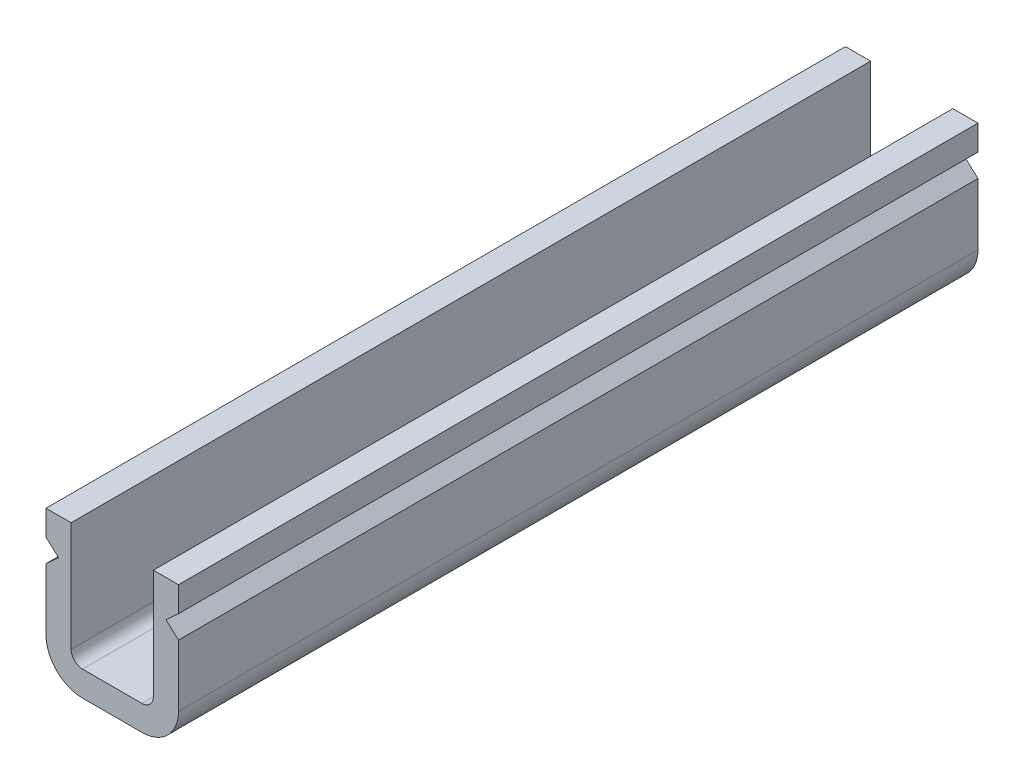
ISO-10303-21;
HEADER;
FILE_DESCRIPTION(('STEP AP214'),'2;1');
FILE_NAME('part.step','',(''),(''),'','','');
FILE_SCHEMA(('AUTOMOTIVE_DESIGN { 1 0 10303 214 1 1 1 1 }'));
ENDSEC;
DATA;
#1=APPLICATION_CONTEXT('core data for automotive mechanical design processes');
#2=APPLICATION_PROTOCOL_DEFINITION('international standard','automotive_design',2000,#1);
#3=PRODUCT_CONTEXT('',#1,'mechanical');
#4=PRODUCT('Part','Part','',(#3));
#5=PRODUCT_RELATED_PRODUCT_CATEGORY('part','',(#4));
#6=PRODUCT_DEFINITION_FORMATION('','',#4);
#7=PRODUCT_DEFINITION_CONTEXT('part definition',#1,'design');
#8=PRODUCT_DEFINITION('design','',#6,#7);
#9=PRODUCT_DEFINITION_SHAPE('','',#8);
#10=(LENGTH_UNIT() NAMED_UNIT(*) SI_UNIT(.MILLI.,.METRE.));
#11=(NAMED_UNIT(*) PLANE_ANGLE_UNIT() SI_UNIT($,.RADIAN.));
#12=(NAMED_UNIT(*) SI_UNIT($,.STERADIAN.) SOLID_ANGLE_UNIT());
#13=UNCERTAINTY_MEASURE_WITH_UNIT(LENGTH_MEASURE(1.E-05),#10,'distance_accuracy_value','');
#14=(GEOMETRIC_REPRESENTATION_CONTEXT(3) GLOBAL_UNCERTAINTY_ASSIGNED_CONTEXT((#13)) GLOBAL_UNIT_ASSIGNED_CONTEXT((#10,
#11,#12)) REPRESENTATION_CONTEXT('',''));
#15=CARTESIAN_POINT('',(0.,0.,0.));
#16=DIRECTION('',(0.,0.,1.));
#17=DIRECTION('',(1.,0.,0.));
#18=AXIS2_PLACEMENT_3D('',#15,#16,#17);
#19=CARTESIAN_POINT('',(1.09999999999999,0.,35.));
#20=DIRECTION('',(0.,-1.,0.));
#21=DIRECTION('',(1.,0.,0.));
#22=AXIS2_PLACEMENT_3D('',#19,#20,#21);
#23=PLANE('',#22);
#24=DIRECTION('',(-1.,0.,0.));
#25=VECTOR('',#24,1.);
#26=CARTESIAN_POINT('',(1.09999999999999,0.,0.));
#27=LINE('',#26,#25);
#28=CARTESIAN_POINT('',(1.09999999999999,0.,0.));
#29=VERTEX_POINT('',#28);
#30=CARTESIAN_POINT('',(0.,0.,0.));
#31=VERTEX_POINT('',#30);
#32=EDGE_CURVE('E187',#29,#31,#27,.T.);
#33=ORIENTED_EDGE('',*,*,#32,.T.);
#34=DIRECTION('',(0.,0.,-1.));
#35=VECTOR('',#34,1.);
#36=CARTESIAN_POINT('',(0.,0.,35.));
#37=LINE('',#36,#35);
#38=CARTESIAN_POINT('',(0.,0.,35.));
#39=VERTEX_POINT('',#38);
#40=EDGE_CURVE('E11',#39,#31,#37,.T.);
#41=ORIENTED_EDGE('',*,*,#40,.F.);
#42=DIRECTION('',(-1.,0.,0.));
#43=VECTOR('',#42,1.);
#44=CARTESIAN_POINT('',(1.09999999999999,0.,35.));
#45=LINE('',#44,#43);
#46=CARTESIAN_POINT('',(1.09999999999999,0.,35.));
#47=VERTEX_POINT('',#46);
#48=EDGE_CURVE('E221',#47,#39,#45,.T.);
#49=ORIENTED_EDGE('',*,*,#48,.F.);
#50=DIRECTION('',(0.,0.,-1.));
#51=VECTOR('',#50,1.);
#52=CARTESIAN_POINT('',(1.09999999999999,0.,35.));
#53=LINE('',#52,#51);
#54=EDGE_CURVE('E183',#47,#29,#53,.T.);
#55=ORIENTED_EDGE('',*,*,#54,.T.);
#56=EDGE_LOOP('',(#33,#41,#49,#55));
#57=FACE_BOUND('',#56,.T.);
#58=ADVANCED_FACE('F31',(#57),#23,.F.);
#59=CARTESIAN_POINT('',(0.,0.,35.));
#60=DIRECTION('',(1.,0.,0.));
#61=DIRECTION('',(0.,0.,-1.));
#62=AXIS2_PLACEMENT_3D('',#59,#60,#61);
#63=PLANE('',#62);
#64=DIRECTION('',(0.,-1.,0.));
#65=VECTOR('',#64,1.);
#66=CARTESIAN_POINT('',(0.,0.,0.));
#67=LINE('',#66,#65);
#68=CARTESIAN_POINT('',(0.,-1.1,0.));
#69=VERTEX_POINT('',#68);
#70=EDGE_CURVE('E190',#31,#69,#67,.T.);
#71=ORIENTED_EDGE('',*,*,#70,.T.);
#72=DIRECTION('',(0.,0.,-1.));
#73=VECTOR('',#72,1.);
#74=CARTESIAN_POINT('',(0.,-1.1,35.));
#75=LINE('',#74,#73);
#76=CARTESIAN_POINT('',(0.,-1.1,35.));
#77=VERTEX_POINT('',#76);
#78=EDGE_CURVE('E39',#77,#69,#75,.T.);
#79=ORIENTED_EDGE('',*,*,#78,.F.);
#80=DIRECTION('',(0.,-1.,0.));
#81=VECTOR('',#80,1.);
#82=CARTESIAN_POINT('',(0.,0.,35.));
#83=LINE('',#82,#81);
#84=EDGE_CURVE('E120',#39,#77,#83,.T.);
#85=ORIENTED_EDGE('',*,*,#84,.F.);
#86=ORIENTED_EDGE('',*,*,#40,.T.);
#87=EDGE_LOOP('',(#71,#79,#85,#86));
#88=FACE_BOUND('',#87,.T.);
#89=ADVANCED_FACE('F329',(#88),#63,.F.);
#90=CARTESIAN_POINT('',(0.,-1.1,35.));
#91=DIRECTION('',(0.672672793996313,0.739940073395944,0.));
#92=DIRECTION('',(-0.739940073395944,0.672672793996313,0.));
#93=AXIS2_PLACEMENT_3D('',#90,#91,#92);
#94=PLANE('',#93);
#95=DIRECTION('',(0.739940073395943,-0.672672793996313,0.));
#96=VECTOR('',#95,1.);
#97=CARTESIAN_POINT('',(0.,-1.1,0.));
#98=LINE('',#97,#96);
#99=CARTESIAN_POINT('',(0.549999999999995,-1.6,0.));
#100=VERTEX_POINT('',#99);
#101=EDGE_CURVE('E192',#69,#100,#98,.T.);
#102=ORIENTED_EDGE('',*,*,#101,.T.);
#103=DIRECTION('',(0.,0.,-1.));
#104=VECTOR('',#103,1.);
#105=CARTESIAN_POINT('',(0.549999999999995,-1.6,35.));
#106=LINE('',#105,#104);
#107=CARTESIAN_POINT('',(0.549999999999995,-1.6,35.));
#108=VERTEX_POINT('',#107);
#109=EDGE_CURVE('E258',#108,#100,#106,.T.);
#110=ORIENTED_EDGE('',*,*,#109,.F.);
#111=DIRECTION('',(0.739940073395943,-0.672672793996313,0.));
#112=VECTOR('',#111,1.);
#113=CARTESIAN_POINT('',(0.,-1.1,35.));
#114=LINE('',#113,#112);
#115=EDGE_CURVE('E266',#77,#108,#114,.T.);
#116=ORIENTED_EDGE('',*,*,#115,.F.);
#117=ORIENTED_EDGE('',*,*,#78,.T.);
#118=EDGE_LOOP('',(#102,#110,#116,#117));
#119=FACE_BOUND('',#118,.T.);
#120=ADVANCED_FACE('F264',(#119),#94,.F.);
#121=CARTESIAN_POINT('',(0.,-2.1,35.));
#122=DIRECTION('',(0.672672793996316,-0.739940073395941,0.));
#123=DIRECTION('',(0.739940073395941,0.672672793996316,0.));
#124=AXIS2_PLACEMENT_3D('',#121,#122,#123);
#125=PLANE('',#124);
#126=DIRECTION('',(-0.739940073395941,-0.672672793996316,0.));
#127=VECTOR('',#126,1.);
#128=CARTESIAN_POINT('',(0.,-2.1,0.));
#129=LINE('',#128,#127);
#130=CARTESIAN_POINT('',(0.,-2.1,0.));
#131=VERTEX_POINT('',#130);
#132=EDGE_CURVE('E194',#100,#131,#129,.T.);
#133=ORIENTED_EDGE('',*,*,#132,.T.);
#134=DIRECTION('',(0.,0.,-1.));
#135=VECTOR('',#134,1.);
#136=CARTESIAN_POINT('',(0.,-2.1,35.));
#137=LINE('',#136,#135);
#138=CARTESIAN_POINT('',(0.,-2.1,35.));
#139=VERTEX_POINT('',#138);
#140=EDGE_CURVE('E255',#139,#131,#137,.T.);
#141=ORIENTED_EDGE('',*,*,#140,.F.);
#142=DIRECTION('',(-0.739940073395941,-0.672672793996316,0.));
#143=VECTOR('',#142,1.);
#144=CARTESIAN_POINT('',(0.,-2.1,35.));
#145=LINE('',#144,#143);
#146=EDGE_CURVE('E284',#108,#139,#145,.T.);
#147=ORIENTED_EDGE('',*,*,#146,.F.);
#148=ORIENTED_EDGE('',*,*,#109,.T.);
#149=EDGE_LOOP('',(#133,#141,#147,#148));
#150=FACE_BOUND('',#149,.T.);
#151=ADVANCED_FACE('F275',(#150),#125,.F.);
#152=CARTESIAN_POINT('',(0.,-2.1,35.));
#153=DIRECTION('',(1.,0.,0.));
#154=DIRECTION('',(0.,1.,0.));
#155=AXIS2_PLACEMENT_3D('',#152,#153,#154);
#156=PLANE('',#155);
#157=DIRECTION('',(0.,-1.,0.));
#158=VECTOR('',#157,1.);
#159=CARTESIAN_POINT('',(0.,-2.1,0.));
#160=LINE('',#159,#158);
#161=CARTESIAN_POINT('',(0.,-4.79999999999998,0.));
#162=VERTEX_POINT('',#161);
#163=EDGE_CURVE('E196',#131,#162,#160,.T.);
#164=ORIENTED_EDGE('',*,*,#163,.T.);
#165=DIRECTION('',(0.,0.,-1.));
#166=VECTOR('',#165,1.);
#167=CARTESIAN_POINT('',(0.,-4.79999999999998,35.));
#168=LINE('',#167,#166);
#169=CARTESIAN_POINT('',(0.,-4.79999999999998,35.));
#170=VERTEX_POINT('',#169);
#171=EDGE_CURVE('E252',#170,#162,#168,.T.);
#172=ORIENTED_EDGE('',*,*,#171,.F.);
#173=DIRECTION('',(0.,-1.,0.));
#174=VECTOR('',#173,1.);
#175=CARTESIAN_POINT('',(0.,-2.1,35.));
#176=LINE('',#175,#174);
#177=EDGE_CURVE('E281',#139,#170,#176,.T.);
#178=ORIENTED_EDGE('',*,*,#177,.F.);
#179=ORIENTED_EDGE('',*,*,#140,.T.);
#180=EDGE_LOOP('',(#164,#172,#178,#179));
#181=FACE_BOUND('',#180,.T.);
#182=ADVANCED_FACE('F279',(#181),#156,.F.);
#183=CARTESIAN_POINT('',(1.6,-4.79999999999998,35.));
#184=DIRECTION('',(0.,0.,-1.));
#185=DIRECTION('',(-1.,0.,0.));
#186=AXIS2_PLACEMENT_3D('',#183,#184,#185);
#187=CYLINDRICAL_SURFACE('',#186,1.6);
#188=CARTESIAN_POINT('',(1.6,-4.79999999999998,0.));
#189=DIRECTION('',(0.,0.,1.));
#190=DIRECTION('',(1.,0.,0.));
#191=AXIS2_PLACEMENT_3D('',#188,#189,#190);
#192=CIRCLE('',#191,1.6);
#193=CARTESIAN_POINT('',(1.6,-6.39999999999998,0.));
#194=VERTEX_POINT('',#193);
#195=EDGE_CURVE('E198',#162,#194,#192,.T.);
#196=ORIENTED_EDGE('',*,*,#195,.T.);
#197=DIRECTION('',(0.,0.,-1.));
#198=VECTOR('',#197,1.);
#199=CARTESIAN_POINT('',(1.6,-6.39999999999998,35.));
#200=LINE('',#199,#198);
#201=CARTESIAN_POINT('',(1.6,-6.39999999999998,35.));
#202=VERTEX_POINT('',#201);
#203=EDGE_CURVE('E249',#202,#194,#200,.T.);
#204=ORIENTED_EDGE('',*,*,#203,.F.);
#205=CARTESIAN_POINT('',(1.6,-4.79999999999998,35.));
#206=DIRECTION('',(0.,0.,1.));
#207=DIRECTION('',(1.,0.,0.));
#208=AXIS2_PLACEMENT_3D('',#205,#206,#207);
#209=CIRCLE('',#208,1.6);
#210=EDGE_CURVE('E283',#170,#202,#209,.T.);
#211=ORIENTED_EDGE('',*,*,#210,.F.);
#212=ORIENTED_EDGE('',*,*,#171,.T.);
#213=EDGE_LOOP('',(#196,#204,#211,#212));
#214=FACE_BOUND('',#213,.T.);
#215=ADVANCED_FACE('F342',(#214),#187,.T.);
#216=CARTESIAN_POINT('',(1.6,-6.39999999999998,35.));
#217=DIRECTION('',(0.,1.,0.));
#218=DIRECTION('',(0.,0.,1.));
#219=AXIS2_PLACEMENT_3D('',#216,#217,#218);
#220=PLANE('',#219);
#221=DIRECTION('',(1.,0.,0.));
#222=VECTOR('',#221,1.);
#223=CARTESIAN_POINT('',(1.6,-6.39999999999998,0.));
#224=LINE('',#223,#222);
#225=CARTESIAN_POINT('',(4.19999999999997,-6.39999999999998,0.));
#226=VERTEX_POINT('',#225);
#227=EDGE_CURVE('E200',#194,#226,#224,.T.);
#228=ORIENTED_EDGE('',*,*,#227,.T.);
#229=DIRECTION('',(0.,0.,-1.));
#230=VECTOR('',#229,1.);
#231=CARTESIAN_POINT('',(4.19999999999997,-6.39999999999998,35.));
#232=LINE('',#231,#230);
#233=CARTESIAN_POINT('',(4.19999999999997,-6.39999999999998,35.));
#234=VERTEX_POINT('',#233);
#235=EDGE_CURVE('E246',#234,#226,#232,.T.);
#236=ORIENTED_EDGE('',*,*,#235,.F.);
#237=DIRECTION('',(1.,0.,0.));
#238=VECTOR('',#237,1.);
#239=CARTESIAN_POINT('',(1.6,-6.39999999999998,35.));
#240=LINE('',#239,#238);
#241=EDGE_CURVE('E286',#202,#234,#240,.T.);
#242=ORIENTED_EDGE('',*,*,#241,.F.);
#243=ORIENTED_EDGE('',*,*,#203,.T.);
#244=EDGE_LOOP('',(#228,#236,#242,#243));
#245=FACE_BOUND('',#244,.T.);
#246=ADVANCED_FACE('F345',(#245),#220,.F.);
#247=CARTESIAN_POINT('',(4.19999999999997,-4.79999999999998,35.));
#248=DIRECTION('',(0.,0.,-1.));
#249=DIRECTION('',(-1.,0.,0.));
#250=AXIS2_PLACEMENT_3D('',#247,#248,#249);
#251=CYLINDRICAL_SURFACE('',#250,1.6);
#252=CARTESIAN_POINT('',(4.19999999999997,-4.79999999999998,0.));
#253=DIRECTION('',(0.,0.,1.));
#254=DIRECTION('',(1.,0.,0.));
#255=AXIS2_PLACEMENT_3D('',#252,#253,#254);
#256=CIRCLE('',#255,1.6);
#257=CARTESIAN_POINT('',(5.79999999999997,-4.79999999999998,0.));
#258=VERTEX_POINT('',#257);
#259=EDGE_CURVE('E202',#226,#258,#256,.T.);
#260=ORIENTED_EDGE('',*,*,#259,.T.);
#261=DIRECTION('',(0.,0.,-1.));
#262=VECTOR('',#261,1.);
#263=CARTESIAN_POINT('',(5.79999999999997,-4.79999999999998,35.));
#264=LINE('',#263,#262);
#265=CARTESIAN_POINT('',(5.79999999999997,-4.79999999999998,35.));
#266=VERTEX_POINT('',#265);
#267=EDGE_CURVE('E243',#266,#258,#264,.T.);
#268=ORIENTED_EDGE('',*,*,#267,.F.);
#269=CARTESIAN_POINT('',(4.19999999999997,-4.79999999999998,35.));
#270=DIRECTION('',(0.,0.,1.));
#271=DIRECTION('',(1.,0.,0.));
#272=AXIS2_PLACEMENT_3D('',#269,#270,#271);
#273=CIRCLE('',#272,1.6);
#274=EDGE_CURVE('E292',#234,#266,#273,.T.);
#275=ORIENTED_EDGE('',*,*,#274,.F.);
#276=ORIENTED_EDGE('',*,*,#235,.T.);
#277=EDGE_LOOP('',(#260,#268,#275,#276));
#278=FACE_BOUND('',#277,.T.);
#279=ADVANCED_FACE('F349',(#278),#251,.T.);
#280=CARTESIAN_POINT('',(5.79999999999998,-4.79999999999998,35.));
#281=DIRECTION('',(-1.,0.,0.));
#282=DIRECTION('',(0.,-1.,0.));
#283=AXIS2_PLACEMENT_3D('',#280,#281,#282);
#284=PLANE('',#283);
#285=DIRECTION('',(0.,1.,0.));
#286=VECTOR('',#285,1.);
#287=CARTESIAN_POINT('',(5.79999999999998,-4.79999999999998,0.));
#288=LINE('',#287,#286);
#289=CARTESIAN_POINT('',(5.79999999999997,-2.1,0.));
#290=VERTEX_POINT('',#289);
#291=EDGE_CURVE('E204',#258,#290,#288,.T.);
#292=ORIENTED_EDGE('',*,*,#291,.T.);
#293=DIRECTION('',(0.,0.,-1.));
#294=VECTOR('',#293,1.);
#295=CARTESIAN_POINT('',(5.79999999999997,-2.1,35.));
#296=LINE('',#295,#294);
#297=CARTESIAN_POINT('',(5.79999999999997,-2.1,35.));
#298=VERTEX_POINT('',#297);
#299=EDGE_CURVE('E240',#298,#290,#296,.T.);
#300=ORIENTED_EDGE('',*,*,#299,.F.);
#301=DIRECTION('',(0.,1.,0.));
#302=VECTOR('',#301,1.);
#303=CARTESIAN_POINT('',(5.79999999999998,-4.79999999999998,35.));
#304=LINE('',#303,#302);
#305=EDGE_CURVE('E294',#266,#298,#304,.T.);
#306=ORIENTED_EDGE('',*,*,#305,.F.);
#307=ORIENTED_EDGE('',*,*,#267,.T.);
#308=EDGE_LOOP('',(#292,#300,#306,#307));
#309=FACE_BOUND('',#308,.T.);
#310=ADVANCED_FACE('F353',(#309),#284,.F.);
#311=CARTESIAN_POINT('',(5.79999999999997,-2.1,35.));
#312=DIRECTION('',(-0.672672793996319,-0.739940073395937,0.));
#313=DIRECTION('',(0.739940073395937,-0.672672793996319,0.));
#314=AXIS2_PLACEMENT_3D('',#311,#312,#313);
#315=PLANE('',#314);
#316=DIRECTION('',(-0.739940073395937,0.672672793996319,0.));
#317=VECTOR('',#316,1.);
#318=CARTESIAN_POINT('',(5.79999999999997,-2.1,0.));
#319=LINE('',#318,#317);
#320=CARTESIAN_POINT('',(5.24999999999999,-1.6,0.));
#321=VERTEX_POINT('',#320);
#322=EDGE_CURVE('E206',#290,#321,#319,.T.);
#323=ORIENTED_EDGE('',*,*,#322,.T.);
#324=DIRECTION('',(0.,0.,-1.));
#325=VECTOR('',#324,1.);
#326=CARTESIAN_POINT('',(5.24999999999999,-1.6,35.));
#327=LINE('',#326,#325);
#328=CARTESIAN_POINT('',(5.24999999999999,-1.6,35.));
#329=VERTEX_POINT('',#328);
#330=EDGE_CURVE('E237',#329,#321,#327,.T.);
#331=ORIENTED_EDGE('',*,*,#330,.F.);
#332=DIRECTION('',(-0.739940073395937,0.672672793996319,0.));
#333=VECTOR('',#332,1.);
#334=CARTESIAN_POINT('',(5.79999999999997,-2.1,35.));
#335=LINE('',#334,#333);
#336=EDGE_CURVE('E296',#298,#329,#335,.T.);
#337=ORIENTED_EDGE('',*,*,#336,.F.);
#338=ORIENTED_EDGE('',*,*,#299,.T.);
#339=EDGE_LOOP('',(#323,#331,#337,#338));
#340=FACE_BOUND('',#339,.T.);
#341=ADVANCED_FACE('F357',(#340),#315,.F.);
#342=CARTESIAN_POINT('',(5.79999999999997,-1.1,35.));
#343=DIRECTION('',(-0.672672793996317,0.73994007339594,0.));
#344=DIRECTION('',(-0.73994007339594,-0.672672793996317,0.));
#345=AXIS2_PLACEMENT_3D('',#342,#343,#344);
#346=PLANE('',#345);
#347=DIRECTION('',(0.73994007339594,0.672672793996317,0.));
#348=VECTOR('',#347,1.);
#349=CARTESIAN_POINT('',(5.79999999999997,-1.1,0.));
#350=LINE('',#349,#348);
#351=CARTESIAN_POINT('',(5.79999999999997,-1.1,0.));
#352=VERTEX_POINT('',#351);
#353=EDGE_CURVE('E208',#321,#352,#350,.T.);
#354=ORIENTED_EDGE('',*,*,#353,.T.);
#355=DIRECTION('',(0.,0.,-1.));
#356=VECTOR('',#355,1.);
#357=CARTESIAN_POINT('',(5.79999999999997,-1.1,35.));
#358=LINE('',#357,#356);
#359=CARTESIAN_POINT('',(5.79999999999997,-1.1,35.));
#360=VERTEX_POINT('',#359);
#361=EDGE_CURVE('E234',#360,#352,#358,.T.);
#362=ORIENTED_EDGE('',*,*,#361,.F.);
#363=DIRECTION('',(0.73994007339594,0.672672793996317,0.));
#364=VECTOR('',#363,1.);
#365=CARTESIAN_POINT('',(5.79999999999997,-1.1,35.));
#366=LINE('',#365,#364);
#367=EDGE_CURVE('E298',#329,#360,#366,.T.);
#368=ORIENTED_EDGE('',*,*,#367,.F.);
#369=ORIENTED_EDGE('',*,*,#330,.T.);
#370=EDGE_LOOP('',(#354,#362,#368,#369));
#371=FACE_BOUND('',#370,.T.);
#372=ADVANCED_FACE('F361',(#371),#346,.F.);
#373=CARTESIAN_POINT('',(5.79999999999997,-1.1,35.));
#374=DIRECTION('',(-1.,0.,0.));
#375=DIRECTION('',(0.,0.,1.));
#376=AXIS2_PLACEMENT_3D('',#373,#374,#375);
#377=PLANE('',#376);
#378=DIRECTION('',(0.,1.,0.));
#379=VECTOR('',#378,1.);
#380=CARTESIAN_POINT('',(5.79999999999997,-1.1,0.));
#381=LINE('',#380,#379);
#382=CARTESIAN_POINT('',(5.79999999999997,0.,0.));
#383=VERTEX_POINT('',#382);
#384=EDGE_CURVE('E210',#352,#383,#381,.T.);
#385=ORIENTED_EDGE('',*,*,#384,.T.);
#386=DIRECTION('',(0.,0.,-1.));
#387=VECTOR('',#386,1.);
#388=CARTESIAN_POINT('',(5.79999999999997,0.,35.));
#389=LINE('',#388,#387);
#390=CARTESIAN_POINT('',(5.79999999999997,0.,35.));
#391=VERTEX_POINT('',#390);
#392=EDGE_CURVE('E231',#391,#383,#389,.T.);
#393=ORIENTED_EDGE('',*,*,#392,.F.);
#394=DIRECTION('',(0.,1.,0.));
#395=VECTOR('',#394,1.);
#396=CARTESIAN_POINT('',(5.79999999999997,-1.1,35.));
#397=LINE('',#396,#395);
#398=EDGE_CURVE('E300',#360,#391,#397,.T.);
#399=ORIENTED_EDGE('',*,*,#398,.F.);
#400=ORIENTED_EDGE('',*,*,#361,.T.);
#401=EDGE_LOOP('',(#385,#393,#399,#400));
#402=FACE_BOUND('',#401,.T.);
#403=ADVANCED_FACE('F365',(#402),#377,.F.);
#404=CARTESIAN_POINT('',(5.79999999999997,0.,35.));
#405=DIRECTION('',(0.,-1.,0.));
#406=DIRECTION('',(1.,0.,0.));
#407=AXIS2_PLACEMENT_3D('',#404,#405,#406);
#408=PLANE('',#407);
#409=DIRECTION('',(-1.,0.,0.));
#410=VECTOR('',#409,1.);
#411=CARTESIAN_POINT('',(5.79999999999997,0.,0.));
#412=LINE('',#411,#410);
#413=CARTESIAN_POINT('',(4.69999999999999,0.,0.));
#414=VERTEX_POINT('',#413);
#415=EDGE_CURVE('E212',#383,#414,#412,.T.);
#416=ORIENTED_EDGE('',*,*,#415,.T.);
#417=DIRECTION('',(0.,0.,-1.));
#418=VECTOR('',#417,1.);
#419=CARTESIAN_POINT('',(4.69999999999999,0.,35.));
#420=LINE('',#419,#418);
#421=CARTESIAN_POINT('',(4.69999999999999,0.,35.));
#422=VERTEX_POINT('',#421);
#423=EDGE_CURVE('E228',#422,#414,#420,.T.);
#424=ORIENTED_EDGE('',*,*,#423,.F.);
#425=DIRECTION('',(-1.,0.,0.));
#426=VECTOR('',#425,1.);
#427=CARTESIAN_POINT('',(5.79999999999997,0.,35.));
#428=LINE('',#427,#426);
#429=EDGE_CURVE('E302',#391,#422,#428,.T.);
#430=ORIENTED_EDGE('',*,*,#429,.F.);
#431=ORIENTED_EDGE('',*,*,#392,.T.);
#432=EDGE_LOOP('',(#416,#424,#430,#431));
#433=FACE_BOUND('',#432,.T.);
#434=ADVANCED_FACE('F369',(#433),#408,.F.);
#435=CARTESIAN_POINT('',(4.69999999999999,-4.8,35.));
#436=DIRECTION('',(1.,0.,0.));
#437=DIRECTION('',(0.,0.,-1.));
#438=AXIS2_PLACEMENT_3D('',#435,#436,#437);
#439=PLANE('',#438);
#440=DIRECTION('',(0.,-1.,0.));
#441=VECTOR('',#440,1.);
#442=CARTESIAN_POINT('',(4.69999999999999,-4.8,0.));
#443=LINE('',#442,#441);
#444=CARTESIAN_POINT('',(4.69999999999999,-4.8,0.));
#445=VERTEX_POINT('',#444);
#446=EDGE_CURVE('E214',#414,#445,#443,.T.);
#447=ORIENTED_EDGE('',*,*,#446,.T.);
#448=DIRECTION('',(0.,0.,-1.));
#449=VECTOR('',#448,1.);
#450=CARTESIAN_POINT('',(4.69999999999999,-4.8,35.));
#451=LINE('',#450,#449);
#452=CARTESIAN_POINT('',(4.69999999999999,-4.8,35.));
#453=VERTEX_POINT('',#452);
#454=EDGE_CURVE('E225',#453,#445,#451,.T.);
#455=ORIENTED_EDGE('',*,*,#454,.F.);
#456=DIRECTION('',(0.,-1.,0.));
#457=VECTOR('',#456,1.);
#458=CARTESIAN_POINT('',(4.69999999999999,-4.8,35.));
#459=LINE('',#458,#457);
#460=EDGE_CURVE('E304',#422,#453,#459,.T.);
#461=ORIENTED_EDGE('',*,*,#460,.F.);
#462=ORIENTED_EDGE('',*,*,#423,.T.);
#463=EDGE_LOOP('',(#447,#455,#461,#462));
#464=FACE_BOUND('',#463,.T.);
#465=ADVANCED_FACE('F310',(#464),#439,.F.);
#466=CARTESIAN_POINT('',(4.19999999999999,-4.8,35.));
#467=DIRECTION('',(0.,0.,-1.));
#468=DIRECTION('',(-1.,0.,0.));
#469=AXIS2_PLACEMENT_3D('',#466,#467,#468);
#470=CYLINDRICAL_SURFACE('',#469,0.5);
#471=CARTESIAN_POINT('',(4.19999999999999,-4.8,0.));
#472=DIRECTION('',(0.,0.,-1.));
#473=DIRECTION('',(-1.,0.,0.));
#474=AXIS2_PLACEMENT_3D('',#471,#472,#473);
#475=CIRCLE('',#474,0.5);
#476=CARTESIAN_POINT('',(4.19999999999999,-5.3,0.));
#477=VERTEX_POINT('',#476);
#478=EDGE_CURVE('E216',#445,#477,#475,.T.);
#479=ORIENTED_EDGE('',*,*,#478,.T.);
#480=DIRECTION('',(0.,0.,-1.));
#481=VECTOR('',#480,1.);
#482=CARTESIAN_POINT('',(4.19999999999999,-5.3,35.));
#483=LINE('',#482,#481);
#484=CARTESIAN_POINT('',(4.19999999999999,-5.3,35.));
#485=VERTEX_POINT('',#484);
#486=EDGE_CURVE('E178',#485,#477,#483,.T.);
#487=ORIENTED_EDGE('',*,*,#486,.F.);
#488=CARTESIAN_POINT('',(4.19999999999999,-4.8,35.));
#489=DIRECTION('',(0.,0.,-1.));
#490=DIRECTION('',(-1.,0.,0.));
#491=AXIS2_PLACEMENT_3D('',#488,#489,#490);
#492=CIRCLE('',#491,0.5);
#493=EDGE_CURVE('E169',#453,#485,#492,.T.);
#494=ORIENTED_EDGE('',*,*,#493,.F.);
#495=ORIENTED_EDGE('',*,*,#454,.T.);
#496=EDGE_LOOP('',(#479,#487,#494,#495));
#497=FACE_BOUND('',#496,.T.);
#498=ADVANCED_FACE('F314',(#497),#470,.F.);
#499=CARTESIAN_POINT('',(1.59999999999999,-5.3,35.));
#500=DIRECTION('',(0.,-1.,0.));
#501=DIRECTION('',(0.,0.,-1.));
#502=AXIS2_PLACEMENT_3D('',#499,#500,#501);
#503=PLANE('',#502);
#504=DIRECTION('',(-1.,0.,0.));
#505=VECTOR('',#504,1.);
#506=CARTESIAN_POINT('',(1.59999999999999,-5.3,0.));
#507=LINE('',#506,#505);
#508=CARTESIAN_POINT('',(1.59999999999999,-5.3,0.));
#509=VERTEX_POINT('',#508);
#510=EDGE_CURVE('E177',#477,#509,#507,.T.);
#511=ORIENTED_EDGE('',*,*,#510,.T.);
#512=DIRECTION('',(0.,0.,-1.));
#513=VECTOR('',#512,1.);
#514=CARTESIAN_POINT('',(1.59999999999999,-5.3,35.));
#515=LINE('',#514,#513);
#516=CARTESIAN_POINT('',(1.59999999999999,-5.3,35.));
#517=VERTEX_POINT('',#516);
#518=EDGE_CURVE('E174',#517,#509,#515,.T.);
#519=ORIENTED_EDGE('',*,*,#518,.F.);
#520=DIRECTION('',(-1.,0.,0.));
#521=VECTOR('',#520,1.);
#522=CARTESIAN_POINT('',(1.59999999999999,-5.3,35.));
#523=LINE('',#522,#521);
#524=EDGE_CURVE('E163',#485,#517,#523,.T.);
#525=ORIENTED_EDGE('',*,*,#524,.F.);
#526=ORIENTED_EDGE('',*,*,#486,.T.);
#527=EDGE_LOOP('',(#511,#519,#525,#526));
#528=FACE_BOUND('',#527,.T.);
#529=ADVANCED_FACE('F175',(#528),#503,.F.);
#530=CARTESIAN_POINT('',(1.59999999999999,-4.8,35.));
#531=DIRECTION('',(0.,0.,-1.));
#532=DIRECTION('',(-1.,0.,0.));
#533=AXIS2_PLACEMENT_3D('',#530,#531,#532);
#534=CYLINDRICAL_SURFACE('',#533,0.5);
#535=CARTESIAN_POINT('',(1.59999999999999,-4.8,0.));
#536=DIRECTION('',(0.,0.,-1.));
#537=DIRECTION('',(1.,0.,0.));
#538=AXIS2_PLACEMENT_3D('',#535,#536,#537);
#539=CIRCLE('',#538,0.5);
#540=CARTESIAN_POINT('',(1.09999999999999,-4.8,0.));
#541=VERTEX_POINT('',#540);
#542=EDGE_CURVE('E106',#509,#541,#539,.T.);
#543=ORIENTED_EDGE('',*,*,#542,.T.);
#544=DIRECTION('',(0.,0.,-1.));
#545=VECTOR('',#544,1.);
#546=CARTESIAN_POINT('',(1.09999999999999,-4.8,35.));
#547=LINE('',#546,#545);
#548=CARTESIAN_POINT('',(1.09999999999999,-4.8,35.));
#549=VERTEX_POINT('',#548);
#550=EDGE_CURVE('E179',#549,#541,#547,.T.);
#551=ORIENTED_EDGE('',*,*,#550,.F.);
#552=CARTESIAN_POINT('',(1.59999999999999,-4.8,35.));
#553=DIRECTION('',(0.,0.,-1.));
#554=DIRECTION('',(1.,0.,0.));
#555=AXIS2_PLACEMENT_3D('',#552,#553,#554);
#556=CIRCLE('',#555,0.5);
#557=EDGE_CURVE('E167',#517,#549,#556,.T.);
#558=ORIENTED_EDGE('',*,*,#557,.F.);
#559=ORIENTED_EDGE('',*,*,#518,.T.);
#560=EDGE_LOOP('',(#543,#551,#558,#559));
#561=FACE_BOUND('',#560,.T.);
#562=ADVANCED_FACE('F181',(#561),#534,.F.);
#563=CARTESIAN_POINT('',(1.09999999999999,0.,35.));
#564=DIRECTION('',(-1.,0.,0.));
#565=DIRECTION('',(0.,-1.,0.));
#566=AXIS2_PLACEMENT_3D('',#563,#564,#565);
#567=PLANE('',#566);
#568=DIRECTION('',(0.,1.,0.));
#569=VECTOR('',#568,1.);
#570=CARTESIAN_POINT('',(1.09999999999999,0.,0.));
#571=LINE('',#570,#569);
#572=EDGE_CURVE('E112',#541,#29,#571,.T.);
#573=ORIENTED_EDGE('',*,*,#572,.T.);
#574=ORIENTED_EDGE('',*,*,#54,.F.);
#575=DIRECTION('',(0.,1.,0.));
#576=VECTOR('',#575,1.);
#577=CARTESIAN_POINT('',(1.09999999999999,0.,35.));
#578=LINE('',#577,#576);
#579=EDGE_CURVE('E47',#549,#47,#578,.T.);
#580=ORIENTED_EDGE('',*,*,#579,.F.);
#581=ORIENTED_EDGE('',*,*,#550,.T.);
#582=EDGE_LOOP('',(#573,#574,#580,#581));
#583=FACE_BOUND('',#582,.T.);
#584=ADVANCED_FACE('F318',(#583),#567,.F.);
#585=CARTESIAN_POINT('',(1.6,-4.79999999999998,35.));
#586=DIRECTION('',(0.,0.,1.));
#587=DIRECTION('',(1.,0.,0.));
#588=AXIS2_PLACEMENT_3D('',#585,#586,#587);
#589=PLANE('',#588);
#590=ORIENTED_EDGE('',*,*,#48,.T.);
#591=ORIENTED_EDGE('',*,*,#84,.T.);
#592=ORIENTED_EDGE('',*,*,#115,.T.);
#593=ORIENTED_EDGE('',*,*,#146,.T.);
#594=ORIENTED_EDGE('',*,*,#177,.T.);
#595=ORIENTED_EDGE('',*,*,#210,.T.);
#596=ORIENTED_EDGE('',*,*,#241,.T.);
#597=ORIENTED_EDGE('',*,*,#274,.T.);
#598=ORIENTED_EDGE('',*,*,#305,.T.);
#599=ORIENTED_EDGE('',*,*,#336,.T.);
#600=ORIENTED_EDGE('',*,*,#367,.T.);
#601=ORIENTED_EDGE('',*,*,#398,.T.);
#602=ORIENTED_EDGE('',*,*,#429,.T.);
#603=ORIENTED_EDGE('',*,*,#460,.T.);
#604=ORIENTED_EDGE('',*,*,#493,.T.);
#605=ORIENTED_EDGE('',*,*,#524,.T.);
#606=ORIENTED_EDGE('',*,*,#557,.T.);
#607=ORIENTED_EDGE('',*,*,#579,.T.);
#608=EDGE_LOOP('',(#590,#591,#592,#593,#594,#595,#596,#597,#598,#599,#600,#601,#602,#603,#604,
#605,#606,#607));
#609=FACE_BOUND('',#608,.T.);
#610=ADVANCED_FACE('F165',(#609),#589,.T.);
#611=CARTESIAN_POINT('',(1.6,-4.79999999999998,0.));
#612=DIRECTION('',(0.,0.,1.));
#613=DIRECTION('',(1.,0.,0.));
#614=AXIS2_PLACEMENT_3D('',#611,#612,#613);
#615=PLANE('',#614);
#616=ORIENTED_EDGE('',*,*,#32,.F.);
#617=ORIENTED_EDGE('',*,*,#572,.F.);
#618=ORIENTED_EDGE('',*,*,#542,.F.);
#619=ORIENTED_EDGE('',*,*,#510,.F.);
#620=ORIENTED_EDGE('',*,*,#478,.F.);
#621=ORIENTED_EDGE('',*,*,#446,.F.);
#622=ORIENTED_EDGE('',*,*,#415,.F.);
#623=ORIENTED_EDGE('',*,*,#384,.F.);
#624=ORIENTED_EDGE('',*,*,#353,.F.);
#625=ORIENTED_EDGE('',*,*,#322,.F.);
#626=ORIENTED_EDGE('',*,*,#291,.F.);
#627=ORIENTED_EDGE('',*,*,#259,.F.);
#628=ORIENTED_EDGE('',*,*,#227,.F.);
#629=ORIENTED_EDGE('',*,*,#195,.F.);
#630=ORIENTED_EDGE('',*,*,#163,.F.);
#631=ORIENTED_EDGE('',*,*,#132,.F.);
#632=ORIENTED_EDGE('',*,*,#101,.F.);
#633=ORIENTED_EDGE('',*,*,#70,.F.);
#634=EDGE_LOOP('',(#616,#617,#618,#619,#620,#621,#622,#623,#624,#625,#626,#627,#628,#629,#630,
#631,#632,#633));
#635=FACE_BOUND('',#634,.T.);
#636=ADVANCED_FACE('F270',(#635),#615,.F.);
#637=CLOSED_SHELL('',(#58,#89,#120,#151,#182,#215,#246,#279,#310,#341,#372,#403,#434,#465,#498,
#529,#562,#584,#610,#636));
#638=MANIFOLD_SOLID_BREP('B2',#637);
#639=ADVANCED_BREP_SHAPE_REPRESENTATION('',(#18,#638),#14);
#640=SHAPE_DEFINITION_REPRESENTATION(#9,#639);
ENDSEC;
END-ISO-10303-21;
